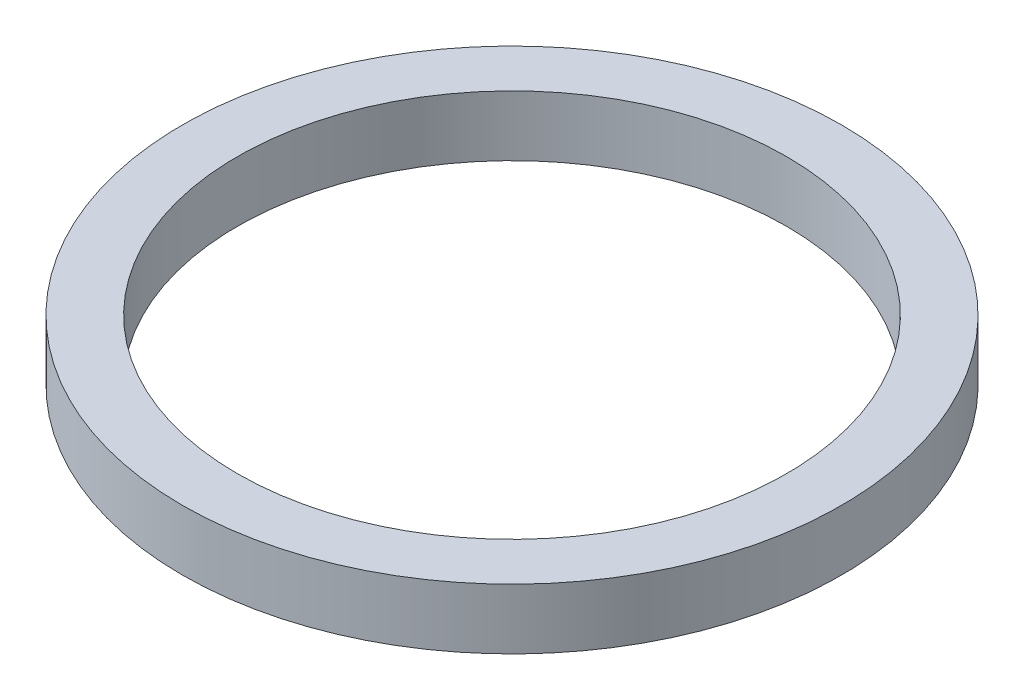
ISO-10303-21;
HEADER;
FILE_DESCRIPTION(('STEP AP214'),'2;1');
FILE_NAME('part.step','',(''),(''),'','','');
FILE_SCHEMA(('AUTOMOTIVE_DESIGN { 1 0 10303 214 1 1 1 1 }'));
ENDSEC;
DATA;
#1=APPLICATION_CONTEXT('core data for automotive mechanical design processes');
#2=APPLICATION_PROTOCOL_DEFINITION('international standard','automotive_design',2000,#1);
#3=PRODUCT_CONTEXT('',#1,'mechanical');
#4=PRODUCT('Part','Part','',(#3));
#5=PRODUCT_RELATED_PRODUCT_CATEGORY('part','',(#4));
#6=PRODUCT_DEFINITION_FORMATION('','',#4);
#7=PRODUCT_DEFINITION_CONTEXT('part definition',#1,'design');
#8=PRODUCT_DEFINITION('design','',#6,#7);
#9=PRODUCT_DEFINITION_SHAPE('','',#8);
#10=(LENGTH_UNIT() NAMED_UNIT(*) SI_UNIT(.MILLI.,.METRE.));
#11=(NAMED_UNIT(*) PLANE_ANGLE_UNIT() SI_UNIT($,.RADIAN.));
#12=(NAMED_UNIT(*) SI_UNIT($,.STERADIAN.) SOLID_ANGLE_UNIT());
#13=UNCERTAINTY_MEASURE_WITH_UNIT(LENGTH_MEASURE(1.E-05),#10,'distance_accuracy_value','');
#14=(GEOMETRIC_REPRESENTATION_CONTEXT(3) GLOBAL_UNCERTAINTY_ASSIGNED_CONTEXT((#13)) GLOBAL_UNIT_ASSIGNED_CONTEXT((#10,
#11,#12)) REPRESENTATION_CONTEXT('',''));
#15=CARTESIAN_POINT('',(0.,0.,0.));
#16=DIRECTION('',(0.,0.,1.));
#17=DIRECTION('',(1.,0.,0.));
#18=AXIS2_PLACEMENT_3D('',#15,#16,#17);
#19=CARTESIAN_POINT('',(0.,11.,0.));
#20=DIRECTION('',(0.,-1.,0.));
#21=DIRECTION('',(0.,0.,-1.));
#22=AXIS2_PLACEMENT_3D('',#19,#20,#21);
#23=CYLINDRICAL_SURFACE('',#22,60.);
#24=CARTESIAN_POINT('',(0.,11.,0.));
#25=DIRECTION('',(0.,1.,0.));
#26=DIRECTION('',(0.,0.,1.));
#27=AXIS2_PLACEMENT_3D('',#24,#25,#26);
#28=CIRCLE('',#27,60.);
#29=CARTESIAN_POINT('',(0.,11.,60.));
#30=VERTEX_POINT('',#29);
#31=EDGE_CURVE('E10',#30,#30,#28,.T.);
#32=ORIENTED_EDGE('',*,*,#31,.F.);
#33=EDGE_LOOP('',(#32));
#34=FACE_BOUND('',#33,.T.);
#35=CARTESIAN_POINT('',(0.,0.,0.));
#36=DIRECTION('',(0.,1.,0.));
#37=DIRECTION('',(0.,0.,1.));
#38=AXIS2_PLACEMENT_3D('',#35,#36,#37);
#39=CIRCLE('',#38,60.);
#40=CARTESIAN_POINT('',(0.,0.,60.));
#41=VERTEX_POINT('',#40);
#42=EDGE_CURVE('E37',#41,#41,#39,.T.);
#43=ORIENTED_EDGE('',*,*,#42,.T.);
#44=EDGE_LOOP('',(#43));
#45=FACE_BOUND('',#44,.T.);
#46=ADVANCED_FACE('F40',(#34,#45),#23,.T.);
#47=CARTESIAN_POINT('',(0.,11.,0.));
#48=DIRECTION('',(0.,1.,0.));
#49=DIRECTION('',(0.,0.,1.));
#50=AXIS2_PLACEMENT_3D('',#47,#48,#49);
#51=PLANE('',#50);
#52=CARTESIAN_POINT('',(0.,11.,0.));
#53=DIRECTION('',(0.,1.,0.));
#54=DIRECTION('',(0.,0.,1.));
#55=AXIS2_PLACEMENT_3D('',#52,#53,#54);
#56=CIRCLE('',#55,50.);
#57=CARTESIAN_POINT('',(0.,11.,50.));
#58=VERTEX_POINT('',#57);
#59=EDGE_CURVE('E50',#58,#58,#56,.T.);
#60=ORIENTED_EDGE('',*,*,#59,.F.);
#61=EDGE_LOOP('',(#60));
#62=FACE_BOUND('',#61,.T.);
#63=ORIENTED_EDGE('',*,*,#31,.T.);
#64=EDGE_LOOP('',(#63));
#65=FACE_BOUND('',#64,.T.);
#66=ADVANCED_FACE('F59',(#62,#65),#51,.T.);
#67=CARTESIAN_POINT('',(0.,0.,0.));
#68=DIRECTION('',(0.,1.,0.));
#69=DIRECTION('',(0.,0.,1.));
#70=AXIS2_PLACEMENT_3D('',#67,#68,#69);
#71=PLANE('',#70);
#72=CARTESIAN_POINT('',(0.,0.,0.));
#73=DIRECTION('',(0.,1.,0.));
#74=DIRECTION('',(0.,0.,1.));
#75=AXIS2_PLACEMENT_3D('',#72,#73,#74);
#76=CIRCLE('',#75,50.);
#77=CARTESIAN_POINT('',(0.,0.,50.));
#78=VERTEX_POINT('',#77);
#79=EDGE_CURVE('E47',#78,#78,#76,.T.);
#80=ORIENTED_EDGE('',*,*,#79,.T.);
#81=EDGE_LOOP('',(#80));
#82=FACE_BOUND('',#81,.T.);
#83=ORIENTED_EDGE('',*,*,#42,.F.);
#84=EDGE_LOOP('',(#83));
#85=FACE_BOUND('',#84,.T.);
#86=ADVANCED_FACE('F58',(#82,#85),#71,.F.);
#87=CARTESIAN_POINT('',(0.,11.,0.));
#88=DIRECTION('',(0.,-1.,0.));
#89=DIRECTION('',(0.,0.,-1.));
#90=AXIS2_PLACEMENT_3D('',#87,#88,#89);
#91=CYLINDRICAL_SURFACE('',#90,50.);
#92=ORIENTED_EDGE('',*,*,#59,.T.);
#93=EDGE_LOOP('',(#92));
#94=FACE_BOUND('',#93,.T.);
#95=ORIENTED_EDGE('',*,*,#79,.F.);
#96=EDGE_LOOP('',(#95));
#97=FACE_BOUND('',#96,.T.);
#98=ADVANCED_FACE('F54',(#94,#97),#91,.F.);
#99=CLOSED_SHELL('',(#46,#66,#86,#98));
#100=MANIFOLD_SOLID_BREP('B2',#99);
#101=ADVANCED_BREP_SHAPE_REPRESENTATION('',(#18,#100),#14);
#102=SHAPE_DEFINITION_REPRESENTATION(#9,#101);
ENDSEC;
END-ISO-10303-21;
